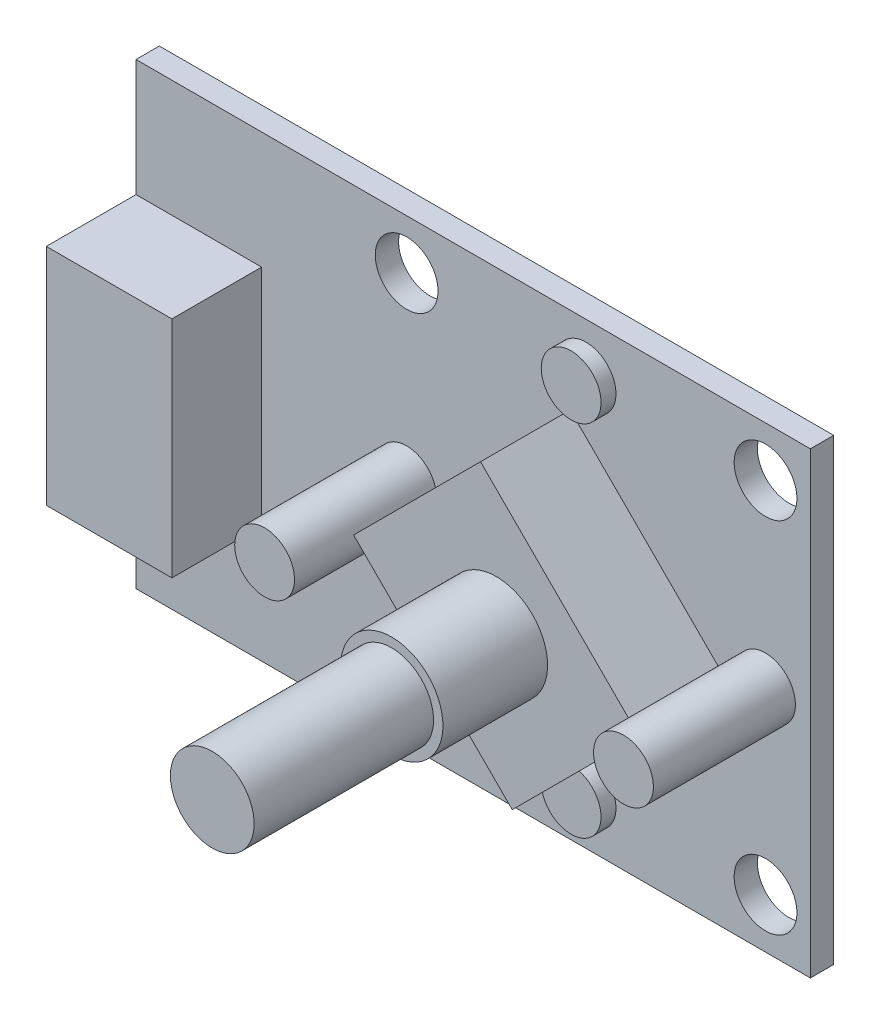
ISO-10303-21;
HEADER;
FILE_DESCRIPTION(('STEP AP214'),'2;1');
FILE_NAME('part.step','',(''),(''),'','','');
FILE_SCHEMA(('AUTOMOTIVE_DESIGN { 1 0 10303 214 1 1 1 1 }'));
ENDSEC;
DATA;
#1=APPLICATION_CONTEXT('core data for automotive mechanical design processes');
#2=APPLICATION_PROTOCOL_DEFINITION('international standard','automotive_design',2000,#1);
#3=PRODUCT_CONTEXT('',#1,'mechanical');
#4=PRODUCT('Part','Part','',(#3));
#5=PRODUCT_RELATED_PRODUCT_CATEGORY('part','',(#4));
#6=PRODUCT_DEFINITION_FORMATION('','',#4);
#7=PRODUCT_DEFINITION_CONTEXT('part definition',#1,'design');
#8=PRODUCT_DEFINITION('design','',#6,#7);
#9=PRODUCT_DEFINITION_SHAPE('','',#8);
#10=(LENGTH_UNIT() NAMED_UNIT(*) SI_UNIT(.MILLI.,.METRE.));
#11=(NAMED_UNIT(*) PLANE_ANGLE_UNIT() SI_UNIT($,.RADIAN.));
#12=(NAMED_UNIT(*) SI_UNIT($,.STERADIAN.) SOLID_ANGLE_UNIT());
#13=UNCERTAINTY_MEASURE_WITH_UNIT(LENGTH_MEASURE(1.E-05),#10,'distance_accuracy_value','');
#14=(GEOMETRIC_REPRESENTATION_CONTEXT(3) GLOBAL_UNCERTAINTY_ASSIGNED_CONTEXT((#13)) GLOBAL_UNIT_ASSIGNED_CONTEXT((#10,
#11,#12)) REPRESENTATION_CONTEXT('',''));
#15=CARTESIAN_POINT('',(0.,0.,0.));
#16=DIRECTION('',(0.,0.,1.));
#17=DIRECTION('',(1.,0.,0.));
#18=AXIS2_PLACEMENT_3D('',#15,#16,#17);
#19=CARTESIAN_POINT('',(0.,0.,0.));
#20=DIRECTION('',(0.,0.,1.));
#21=DIRECTION('',(1.,0.,0.));
#22=AXIS2_PLACEMENT_3D('',#19,#20,#21);
#23=PLANE('',#22);
#24=CARTESIAN_POINT('',(19.55,-12.,0.));
#25=DIRECTION('',(0.,0.,-1.));
#26=DIRECTION('',(1.,0.,0.));
#27=AXIS2_PLACEMENT_3D('',#24,#25,#26);
#28=CIRCLE('',#27,2.1);
#29=CARTESIAN_POINT('',(17.45,-12.,0.));
#30=VERTEX_POINT('',#29);
#31=EDGE_CURVE('P0_E123',#30,#30,#28,.T.);
#32=ORIENTED_EDGE('',*,*,#31,.F.);
#33=EDGE_LOOP('',(#32));
#34=FACE_BOUND('',#33,.T.);
#35=CARTESIAN_POINT('',(19.55,12.,0.));
#36=DIRECTION('',(0.,0.,-1.));
#37=DIRECTION('',(1.,0.,0.));
#38=AXIS2_PLACEMENT_3D('',#35,#36,#37);
#39=CIRCLE('',#38,2.1);
#40=CARTESIAN_POINT('',(17.45,12.,0.));
#41=VERTEX_POINT('',#40);
#42=EDGE_CURVE('P0_E153',#41,#41,#39,.T.);
#43=ORIENTED_EDGE('',*,*,#42,.F.);
#44=EDGE_LOOP('',(#43));
#45=FACE_BOUND('',#44,.T.);
#46=CARTESIAN_POINT('',(-4.45,-12.,0.));
#47=DIRECTION('',(0.,0.,-1.));
#48=DIRECTION('',(1.,0.,0.));
#49=AXIS2_PLACEMENT_3D('',#46,#47,#48);
#50=CIRCLE('',#49,2.1);
#51=CARTESIAN_POINT('',(-6.55,-12.,0.));
#52=VERTEX_POINT('',#51);
#53=EDGE_CURVE('P0_E129',#52,#52,#50,.T.);
#54=ORIENTED_EDGE('',*,*,#53,.F.);
#55=EDGE_LOOP('',(#54));
#56=FACE_BOUND('',#55,.T.);
#57=CARTESIAN_POINT('',(-4.45,12.,0.));
#58=DIRECTION('',(0.,0.,-1.));
#59=DIRECTION('',(1.,0.,0.));
#60=AXIS2_PLACEMENT_3D('',#57,#58,#59);
#61=CIRCLE('',#60,2.1);
#62=CARTESIAN_POINT('',(-6.55,12.,0.));
#63=VERTEX_POINT('',#62);
#64=EDGE_CURVE('P0_E114',#63,#63,#61,.T.);
#65=ORIENTED_EDGE('',*,*,#64,.F.);
#66=EDGE_LOOP('',(#65));
#67=FACE_BOUND('',#66,.T.);
#68=DIRECTION('',(0.,-1.,0.));
#69=VECTOR('',#68,1.);
#70=CARTESIAN_POINT('',(-22.55,7.5,0.));
#71=LINE('',#70,#69);
#72=CARTESIAN_POINT('',(-22.55,15.325,0.));
#73=VERTEX_POINT('',#72);
#74=CARTESIAN_POINT('',(-22.55,-15.325,0.));
#75=VERTEX_POINT('',#74);
#76=EDGE_CURVE('P0_E28',#73,#75,#71,.T.);
#77=ORIENTED_EDGE('',*,*,#76,.F.);
#78=DIRECTION('',(-1.,0.,0.));
#79=VECTOR('',#78,1.);
#80=CARTESIAN_POINT('',(22.55,15.325,0.));
#81=LINE('',#80,#79);
#82=CARTESIAN_POINT('',(22.55,15.325,0.));
#83=VERTEX_POINT('',#82);
#84=EDGE_CURVE('P0_E99',#83,#73,#81,.T.);
#85=ORIENTED_EDGE('',*,*,#84,.F.);
#86=DIRECTION('',(0.,1.,0.));
#87=VECTOR('',#86,1.);
#88=CARTESIAN_POINT('',(22.55,-15.325,0.));
#89=LINE('',#88,#87);
#90=CARTESIAN_POINT('',(22.55,-15.325,0.));
#91=VERTEX_POINT('',#90);
#92=EDGE_CURVE('P0_E139',#91,#83,#89,.T.);
#93=ORIENTED_EDGE('',*,*,#92,.F.);
#94=DIRECTION('',(1.,0.,0.));
#95=VECTOR('',#94,1.);
#96=CARTESIAN_POINT('',(-22.55,-15.325,0.));
#97=LINE('',#96,#95);
#98=EDGE_CURVE('P0_E55',#75,#91,#97,.T.);
#99=ORIENTED_EDGE('',*,*,#98,.F.);
#100=EDGE_LOOP('',(#77,#85,#93,#99));
#101=FACE_BOUND('',#100,.T.);
#102=ADVANCED_FACE('P0_F17',(#34,#45,#56,#67,#101),#23,.F.);
#103=CARTESIAN_POINT('',(0.,0.,1.56));
#104=DIRECTION('',(0.,0.,1.));
#105=DIRECTION('',(1.,0.,0.));
#106=AXIS2_PLACEMENT_3D('',#103,#104,#105);
#107=PLANE('',#106);
#108=CARTESIAN_POINT('',(19.55,-12.,1.56));
#109=DIRECTION('',(0.,0.,-1.));
#110=DIRECTION('',(1.,0.,0.));
#111=AXIS2_PLACEMENT_3D('',#108,#109,#110);
#112=CIRCLE('',#111,2.1);
#113=CARTESIAN_POINT('',(17.45,-12.,1.56));
#114=VERTEX_POINT('',#113);
#115=EDGE_CURVE('P0_E131',#114,#114,#112,.T.);
#116=ORIENTED_EDGE('',*,*,#115,.T.);
#117=EDGE_LOOP('',(#116));
#118=FACE_BOUND('',#117,.T.);
#119=CARTESIAN_POINT('',(19.55,12.,1.56));
#120=DIRECTION('',(0.,0.,-1.));
#121=DIRECTION('',(1.,0.,0.));
#122=AXIS2_PLACEMENT_3D('',#119,#120,#121);
#123=CIRCLE('',#122,2.1);
#124=CARTESIAN_POINT('',(17.45,12.,1.56));
#125=VERTEX_POINT('',#124);
#126=EDGE_CURVE('P0_E169',#125,#125,#123,.T.);
#127=ORIENTED_EDGE('',*,*,#126,.T.);
#128=EDGE_LOOP('',(#127));
#129=FACE_BOUND('',#128,.T.);
#130=CARTESIAN_POINT('',(-4.45,-12.,1.56));
#131=DIRECTION('',(0.,0.,-1.));
#132=DIRECTION('',(1.,0.,0.));
#133=AXIS2_PLACEMENT_3D('',#130,#131,#132);
#134=CIRCLE('',#133,2.1);
#135=CARTESIAN_POINT('',(-6.55,-12.,1.56));
#136=VERTEX_POINT('',#135);
#137=EDGE_CURVE('P0_E130',#136,#136,#134,.T.);
#138=ORIENTED_EDGE('',*,*,#137,.T.);
#139=EDGE_LOOP('',(#138));
#140=FACE_BOUND('',#139,.T.);
#141=CARTESIAN_POINT('',(-4.45,12.,1.56));
#142=DIRECTION('',(0.,0.,-1.));
#143=DIRECTION('',(1.,0.,0.));
#144=AXIS2_PLACEMENT_3D('',#141,#142,#143);
#145=CIRCLE('',#144,2.1);
#146=CARTESIAN_POINT('',(-6.55,12.,1.56));
#147=VERTEX_POINT('',#146);
#148=EDGE_CURVE('P0_E145',#147,#147,#145,.T.);
#149=ORIENTED_EDGE('',*,*,#148,.T.);
#150=EDGE_LOOP('',(#149));
#151=FACE_BOUND('',#150,.T.);
#152=DIRECTION('',(0.,-1.,0.));
#153=VECTOR('',#152,1.);
#154=CARTESIAN_POINT('',(-22.55,7.5,1.56));
#155=LINE('',#154,#153);
#156=CARTESIAN_POINT('',(-22.55,15.325,1.56));
#157=VERTEX_POINT('',#156);
#158=CARTESIAN_POINT('',(-22.55,-15.325,1.56));
#159=VERTEX_POINT('',#158);
#160=EDGE_CURVE('P0_E11',#157,#159,#155,.T.);
#161=ORIENTED_EDGE('',*,*,#160,.T.);
#162=DIRECTION('',(1.,0.,0.));
#163=VECTOR('',#162,1.);
#164=CARTESIAN_POINT('',(-22.55,-15.325,1.56));
#165=LINE('',#164,#163);
#166=CARTESIAN_POINT('',(22.55,-15.325,1.56));
#167=VERTEX_POINT('',#166);
#168=EDGE_CURVE('P0_E142',#159,#167,#165,.T.);
#169=ORIENTED_EDGE('',*,*,#168,.T.);
#170=DIRECTION('',(0.,1.,0.));
#171=VECTOR('',#170,1.);
#172=CARTESIAN_POINT('',(22.55,-15.325,1.56));
#173=LINE('',#172,#171);
#174=CARTESIAN_POINT('',(22.55,15.325,1.56));
#175=VERTEX_POINT('',#174);
#176=EDGE_CURVE('P0_E67',#167,#175,#173,.T.);
#177=ORIENTED_EDGE('',*,*,#176,.T.);
#178=DIRECTION('',(-1.,0.,0.));
#179=VECTOR('',#178,1.);
#180=CARTESIAN_POINT('',(22.55,15.325,1.56));
#181=LINE('',#180,#179);
#182=EDGE_CURVE('P0_E21',#175,#157,#181,.T.);
#183=ORIENTED_EDGE('',*,*,#182,.T.);
#184=EDGE_LOOP('',(#161,#169,#177,#183));
#185=FACE_BOUND('',#184,.T.);
#186=ADVANCED_FACE('P0_F195',(#118,#129,#140,#151,#185),#107,.T.);
#187=CARTESIAN_POINT('',(-22.55,15.325,0.));
#188=DIRECTION('',(-1.,0.,0.));
#189=DIRECTION('',(0.,0.,1.));
#190=AXIS2_PLACEMENT_3D('',#187,#188,#189);
#191=PLANE('',#190);
#192=ORIENTED_EDGE('',*,*,#76,.T.);
#193=DIRECTION('',(0.,0.,1.));
#194=VECTOR('',#193,1.);
#195=CARTESIAN_POINT('',(-22.55,-15.325,0.));
#196=LINE('',#195,#194);
#197=EDGE_CURVE('P0_E102',#75,#159,#196,.T.);
#198=ORIENTED_EDGE('',*,*,#197,.T.);
#199=ORIENTED_EDGE('',*,*,#160,.F.);
#200=DIRECTION('',(0.,0.,1.));
#201=VECTOR('',#200,1.);
#202=CARTESIAN_POINT('',(-22.55,15.325,0.));
#203=LINE('',#202,#201);
#204=EDGE_CURVE('P0_E105',#73,#157,#203,.T.);
#205=ORIENTED_EDGE('',*,*,#204,.F.);
#206=EDGE_LOOP('',(#192,#198,#199,#205));
#207=FACE_BOUND('',#206,.T.);
#208=ADVANCED_FACE('P0_F19',(#207),#191,.T.);
#209=CARTESIAN_POINT('',(-22.55,-15.325,0.));
#210=DIRECTION('',(0.,-1.,0.));
#211=DIRECTION('',(0.,0.,-1.));
#212=AXIS2_PLACEMENT_3D('',#209,#210,#211);
#213=PLANE('',#212);
#214=ORIENTED_EDGE('',*,*,#98,.T.);
#215=DIRECTION('',(0.,0.,1.));
#216=VECTOR('',#215,1.);
#217=CARTESIAN_POINT('',(22.55,-15.325,0.));
#218=LINE('',#217,#216);
#219=EDGE_CURVE('P0_E138',#91,#167,#218,.T.);
#220=ORIENTED_EDGE('',*,*,#219,.T.);
#221=ORIENTED_EDGE('',*,*,#168,.F.);
#222=ORIENTED_EDGE('',*,*,#197,.F.);
#223=EDGE_LOOP('',(#214,#220,#221,#222));
#224=FACE_BOUND('',#223,.T.);
#225=ADVANCED_FACE('P0_F194',(#224),#213,.T.);
#226=CARTESIAN_POINT('',(22.55,-15.325,0.));
#227=DIRECTION('',(1.,0.,0.));
#228=DIRECTION('',(0.,1.,0.));
#229=AXIS2_PLACEMENT_3D('',#226,#227,#228);
#230=PLANE('',#229);
#231=ORIENTED_EDGE('',*,*,#92,.T.);
#232=DIRECTION('',(0.,0.,1.));
#233=VECTOR('',#232,1.);
#234=CARTESIAN_POINT('',(22.55,15.325,0.));
#235=LINE('',#234,#233);
#236=EDGE_CURVE('P0_E112',#83,#175,#235,.T.);
#237=ORIENTED_EDGE('',*,*,#236,.T.);
#238=ORIENTED_EDGE('',*,*,#176,.F.);
#239=ORIENTED_EDGE('',*,*,#219,.F.);
#240=EDGE_LOOP('',(#231,#237,#238,#239));
#241=FACE_BOUND('',#240,.T.);
#242=ADVANCED_FACE('P0_F192',(#241),#230,.T.);
#243=CARTESIAN_POINT('',(22.55,15.325,0.));
#244=DIRECTION('',(0.,1.,0.));
#245=DIRECTION('',(1.,0.,0.));
#246=AXIS2_PLACEMENT_3D('',#243,#244,#245);
#247=PLANE('',#246);
#248=ORIENTED_EDGE('',*,*,#84,.T.);
#249=ORIENTED_EDGE('',*,*,#204,.T.);
#250=ORIENTED_EDGE('',*,*,#182,.F.);
#251=ORIENTED_EDGE('',*,*,#236,.F.);
#252=EDGE_LOOP('',(#248,#249,#250,#251));
#253=FACE_BOUND('',#252,.T.);
#254=ADVANCED_FACE('P0_F111',(#253),#247,.T.);
#255=CARTESIAN_POINT('',(-4.45,12.,0.));
#256=DIRECTION('',(0.,0.,1.));
#257=DIRECTION('',(1.,0.,0.));
#258=AXIS2_PLACEMENT_3D('',#255,#256,#257);
#259=CYLINDRICAL_SURFACE('',#258,2.1);
#260=ORIENTED_EDGE('',*,*,#148,.F.);
#261=DIRECTION('',(0.,0.,-1.));
#262=VECTOR('',#261,1.);
#263=CARTESIAN_POINT('',(-6.55,12.,0.));
#264=LINE('',#263,#262);
#265=EDGE_CURVE('P0_E120',#147,#63,#264,.T.);
#266=ORIENTED_EDGE('',*,*,#265,.T.);
#267=ORIENTED_EDGE('',*,*,#64,.T.);
#268=ORIENTED_EDGE('',*,*,#265,.F.);
#269=EDGE_LOOP('',(#260,#266,#267,#268));
#270=FACE_BOUND('',#269,.T.);
#271=ADVANCED_FACE('P0_F211',(#270),#259,.F.);
#272=CARTESIAN_POINT('',(-4.45,-12.,0.));
#273=DIRECTION('',(0.,0.,1.));
#274=DIRECTION('',(1.,0.,0.));
#275=AXIS2_PLACEMENT_3D('',#272,#273,#274);
#276=CYLINDRICAL_SURFACE('',#275,2.1);
#277=ORIENTED_EDGE('',*,*,#137,.F.);
#278=DIRECTION('',(0.,0.,-1.));
#279=VECTOR('',#278,1.);
#280=CARTESIAN_POINT('',(-6.55,-12.,0.));
#281=LINE('',#280,#279);
#282=EDGE_CURVE('P0_E125',#136,#52,#281,.T.);
#283=ORIENTED_EDGE('',*,*,#282,.T.);
#284=ORIENTED_EDGE('',*,*,#53,.T.);
#285=ORIENTED_EDGE('',*,*,#282,.F.);
#286=EDGE_LOOP('',(#277,#283,#284,#285));
#287=FACE_BOUND('',#286,.T.);
#288=ADVANCED_FACE('P0_F207',(#287),#276,.F.);
#289=CARTESIAN_POINT('',(19.55,12.,0.));
#290=DIRECTION('',(0.,0.,1.));
#291=DIRECTION('',(1.,0.,0.));
#292=AXIS2_PLACEMENT_3D('',#289,#290,#291);
#293=CYLINDRICAL_SURFACE('',#292,2.1);
#294=ORIENTED_EDGE('',*,*,#126,.F.);
#295=DIRECTION('',(0.,0.,-1.));
#296=VECTOR('',#295,1.);
#297=CARTESIAN_POINT('',(17.45,12.,0.));
#298=LINE('',#297,#296);
#299=EDGE_CURVE('P0_E166',#125,#41,#298,.T.);
#300=ORIENTED_EDGE('',*,*,#299,.T.);
#301=ORIENTED_EDGE('',*,*,#42,.T.);
#302=ORIENTED_EDGE('',*,*,#299,.F.);
#303=EDGE_LOOP('',(#294,#300,#301,#302));
#304=FACE_BOUND('',#303,.T.);
#305=ADVANCED_FACE('P0_F210',(#304),#293,.F.);
#306=CARTESIAN_POINT('',(19.55,-12.,0.));
#307=DIRECTION('',(0.,0.,1.));
#308=DIRECTION('',(1.,0.,0.));
#309=AXIS2_PLACEMENT_3D('',#306,#307,#308);
#310=CYLINDRICAL_SURFACE('',#309,2.1);
#311=ORIENTED_EDGE('',*,*,#115,.F.);
#312=DIRECTION('',(0.,0.,-1.));
#313=VECTOR('',#312,1.);
#314=CARTESIAN_POINT('',(17.45,-12.,0.));
#315=LINE('',#314,#313);
#316=EDGE_CURVE('P0_E135',#114,#30,#315,.T.);
#317=ORIENTED_EDGE('',*,*,#316,.T.);
#318=ORIENTED_EDGE('',*,*,#31,.T.);
#319=ORIENTED_EDGE('',*,*,#316,.F.);
#320=EDGE_LOOP('',(#311,#317,#318,#319));
#321=FACE_BOUND('',#320,.T.);
#322=ADVANCED_FACE('P0_F217',(#321),#310,.F.);
#323=CLOSED_SHELL('',(#102,#186,#208,#225,#242,#254,#271,#288,#305,#322));
#324=MANIFOLD_SOLID_BREP('P0_B1',#323);
#325=CARTESIAN_POINT('',(-18.35,0.,1.56));
#326=DIRECTION('',(0.,0.,1.));
#327=DIRECTION('',(1.,0.,0.));
#328=AXIS2_PLACEMENT_3D('',#325,#326,#327);
#329=PLANE('',#328);
#330=DIRECTION('',(1.,0.,0.));
#331=VECTOR('',#330,1.);
#332=CARTESIAN_POINT('',(-16.25,7.5,1.56));
#333=LINE('',#332,#331);
#334=CARTESIAN_POINT('',(-22.55,7.5,1.56));
#335=VERTEX_POINT('',#334);
#336=CARTESIAN_POINT('',(-14.15,7.5,1.56));
#337=VERTEX_POINT('',#336);
#338=EDGE_CURVE('P1_E27',#335,#337,#333,.T.);
#339=ORIENTED_EDGE('',*,*,#338,.T.);
#340=DIRECTION('',(0.,-1.,0.));
#341=VECTOR('',#340,1.);
#342=CARTESIAN_POINT('',(-14.15,-3.75,1.56));
#343=LINE('',#342,#341);
#344=CARTESIAN_POINT('',(-14.15,-7.5,1.56));
#345=VERTEX_POINT('',#344);
#346=EDGE_CURVE('P1_E68',#337,#345,#343,.T.);
#347=ORIENTED_EDGE('',*,*,#346,.T.);
#348=DIRECTION('',(-1.,0.,0.));
#349=VECTOR('',#348,1.);
#350=CARTESIAN_POINT('',(-20.45,-7.5,1.56));
#351=LINE('',#350,#349);
#352=CARTESIAN_POINT('',(-22.55,-7.5,1.56));
#353=VERTEX_POINT('',#352);
#354=EDGE_CURVE('P1_E92',#345,#353,#351,.T.);
#355=ORIENTED_EDGE('',*,*,#354,.T.);
#356=DIRECTION('',(0.,1.,0.));
#357=VECTOR('',#356,1.);
#358=CARTESIAN_POINT('',(-22.55,3.75,1.56));
#359=LINE('',#358,#357);
#360=EDGE_CURVE('P1_E70',#353,#335,#359,.T.);
#361=ORIENTED_EDGE('',*,*,#360,.T.);
#362=EDGE_LOOP('',(#339,#347,#355,#361));
#363=FACE_BOUND('',#362,.T.);
#364=ADVANCED_FACE('P1_F16',(#363),#329,.F.);
#365=CARTESIAN_POINT('',(-18.35,0.,7.56));
#366=DIRECTION('',(0.,0.,1.));
#367=DIRECTION('',(1.,0.,0.));
#368=AXIS2_PLACEMENT_3D('',#365,#366,#367);
#369=PLANE('',#368);
#370=DIRECTION('',(-1.,0.,0.));
#371=VECTOR('',#370,1.);
#372=CARTESIAN_POINT('',(-16.25,7.5,7.56));
#373=LINE('',#372,#371);
#374=CARTESIAN_POINT('',(-14.15,7.5,7.56));
#375=VERTEX_POINT('',#374);
#376=CARTESIAN_POINT('',(-22.55,7.5,7.56));
#377=VERTEX_POINT('',#376);
#378=EDGE_CURVE('P1_E11',#375,#377,#373,.T.);
#379=ORIENTED_EDGE('',*,*,#378,.T.);
#380=DIRECTION('',(0.,-1.,0.));
#381=VECTOR('',#380,1.);
#382=CARTESIAN_POINT('',(-22.55,3.75,7.56));
#383=LINE('',#382,#381);
#384=CARTESIAN_POINT('',(-22.55,-7.5,7.56));
#385=VERTEX_POINT('',#384);
#386=EDGE_CURVE('P1_E116',#377,#385,#383,.T.);
#387=ORIENTED_EDGE('',*,*,#386,.T.);
#388=DIRECTION('',(1.,0.,0.));
#389=VECTOR('',#388,1.);
#390=CARTESIAN_POINT('',(-20.45,-7.5,7.56));
#391=LINE('',#390,#389);
#392=CARTESIAN_POINT('',(-14.15,-7.5,7.56));
#393=VERTEX_POINT('',#392);
#394=EDGE_CURVE('P1_E94',#385,#393,#391,.T.);
#395=ORIENTED_EDGE('',*,*,#394,.T.);
#396=DIRECTION('',(0.,1.,0.));
#397=VECTOR('',#396,1.);
#398=CARTESIAN_POINT('',(-14.15,-3.75,7.56));
#399=LINE('',#398,#397);
#400=EDGE_CURVE('P1_E79',#393,#375,#399,.T.);
#401=ORIENTED_EDGE('',*,*,#400,.T.);
#402=EDGE_LOOP('',(#379,#387,#395,#401));
#403=FACE_BOUND('',#402,.T.);
#404=ADVANCED_FACE('P1_F171',(#403),#369,.T.);
#405=CARTESIAN_POINT('',(-14.15,7.5,1.56));
#406=DIRECTION('',(0.,1.,0.));
#407=DIRECTION('',(1.,0.,0.));
#408=AXIS2_PLACEMENT_3D('',#405,#406,#407);
#409=PLANE('',#408);
#410=ORIENTED_EDGE('',*,*,#338,.F.);
#411=DIRECTION('',(0.,0.,1.));
#412=VECTOR('',#411,1.);
#413=CARTESIAN_POINT('',(-22.55,7.5,1.56));
#414=LINE('',#413,#412);
#415=EDGE_CURVE('P1_E20',#335,#377,#414,.T.);
#416=ORIENTED_EDGE('',*,*,#415,.T.);
#417=ORIENTED_EDGE('',*,*,#378,.F.);
#418=DIRECTION('',(0.,0.,1.));
#419=VECTOR('',#418,1.);
#420=CARTESIAN_POINT('',(-14.15,7.5,1.56));
#421=LINE('',#420,#419);
#422=EDGE_CURVE('P1_E75',#337,#375,#421,.T.);
#423=ORIENTED_EDGE('',*,*,#422,.F.);
#424=EDGE_LOOP('',(#410,#416,#417,#423));
#425=FACE_BOUND('',#424,.T.);
#426=ADVANCED_FACE('P1_F18',(#425),#409,.T.);
#427=CARTESIAN_POINT('',(-22.55,7.5,1.56));
#428=DIRECTION('',(-1.,0.,0.));
#429=DIRECTION('',(0.,0.,1.));
#430=AXIS2_PLACEMENT_3D('',#427,#428,#429);
#431=PLANE('',#430);
#432=ORIENTED_EDGE('',*,*,#360,.F.);
#433=DIRECTION('',(0.,0.,1.));
#434=VECTOR('',#433,1.);
#435=CARTESIAN_POINT('',(-22.55,-7.5,1.56));
#436=LINE('',#435,#434);
#437=EDGE_CURVE('P1_E97',#353,#385,#436,.T.);
#438=ORIENTED_EDGE('',*,*,#437,.T.);
#439=ORIENTED_EDGE('',*,*,#386,.F.);
#440=ORIENTED_EDGE('',*,*,#415,.F.);
#441=EDGE_LOOP('',(#432,#438,#439,#440));
#442=FACE_BOUND('',#441,.T.);
#443=ADVANCED_FACE('P1_F115',(#442),#431,.T.);
#444=CARTESIAN_POINT('',(-22.55,-7.5,1.56));
#445=DIRECTION('',(0.,-1.,0.));
#446=DIRECTION('',(0.,0.,-1.));
#447=AXIS2_PLACEMENT_3D('',#444,#445,#446);
#448=PLANE('',#447);
#449=ORIENTED_EDGE('',*,*,#354,.F.);
#450=DIRECTION('',(0.,0.,1.));
#451=VECTOR('',#450,1.);
#452=CARTESIAN_POINT('',(-14.15,-7.5,1.56));
#453=LINE('',#452,#451);
#454=EDGE_CURVE('P1_E84',#345,#393,#453,.T.);
#455=ORIENTED_EDGE('',*,*,#454,.T.);
#456=ORIENTED_EDGE('',*,*,#394,.F.);
#457=ORIENTED_EDGE('',*,*,#437,.F.);
#458=EDGE_LOOP('',(#449,#455,#456,#457));
#459=FACE_BOUND('',#458,.T.);
#460=ADVANCED_FACE('P1_F112',(#459),#448,.T.);
#461=CARTESIAN_POINT('',(-14.15,-7.5,1.56));
#462=DIRECTION('',(1.,0.,0.));
#463=DIRECTION('',(0.,1.,0.));
#464=AXIS2_PLACEMENT_3D('',#461,#462,#463);
#465=PLANE('',#464);
#466=ORIENTED_EDGE('',*,*,#346,.F.);
#467=ORIENTED_EDGE('',*,*,#422,.T.);
#468=ORIENTED_EDGE('',*,*,#400,.F.);
#469=ORIENTED_EDGE('',*,*,#454,.F.);
#470=EDGE_LOOP('',(#466,#467,#468,#469));
#471=FACE_BOUND('',#470,.T.);
#472=ADVANCED_FACE('P1_F82',(#471),#465,.T.);
#473=CLOSED_SHELL('',(#364,#404,#426,#443,#460,#472));
#474=MANIFOLD_SOLID_BREP('P1_B1',#473);
#475=CARTESIAN_POINT('',(7.55,0.,1.56));
#476=DIRECTION('',(0.,0.,1.));
#477=DIRECTION('',(1.,0.,0.));
#478=AXIS2_PLACEMENT_3D('',#475,#476,#477);
#479=PLANE('',#478);
#480=DIRECTION('',(-0.707106781186547,0.707106781186548,0.));
#481=VECTOR('',#480,1.);
#482=CARTESIAN_POINT('',(0.655708883431173,-1.59099025766972,1.56));
#483=LINE('',#482,#481);
#484=CARTESIAN_POINT('',(8.61066017177981,-9.54594154601837,1.56));
#485=VERTEX_POINT('',#484);
#486=CARTESIAN_POINT('',(-1.99594154601837,1.06066017177983,1.56));
#487=VERTEX_POINT('',#486);
#488=EDGE_CURVE('P2_E28',#485,#487,#483,.T.);
#489=ORIENTED_EDGE('',*,*,#488,.T.);
#490=DIRECTION('',(0.707106781186548,0.707106781186547,0.));
#491=VECTOR('',#490,1.);
#492=CARTESIAN_POINT('',(4.36801948466056,7.42462120245876,1.56));
#493=LINE('',#492,#491);
#494=CARTESIAN_POINT('',(6.4893398282202,9.54594154601839,1.56));
#495=VERTEX_POINT('',#494);
#496=EDGE_CURVE('P2_E139',#487,#495,#493,.T.);
#497=ORIENTED_EDGE('',*,*,#496,.T.);
#498=DIRECTION('',(0.707106781186547,-0.707106781186548,0.));
#499=VECTOR('',#498,1.);
#500=CARTESIAN_POINT('',(14.4442911165689,1.59099025766973,1.56));
#501=LINE('',#500,#499);
#502=CARTESIAN_POINT('',(17.0959415460184,-1.06066017177983,1.56));
#503=VERTEX_POINT('',#502);
#504=EDGE_CURVE('P2_E120',#495,#503,#501,.T.);
#505=ORIENTED_EDGE('',*,*,#504,.T.);
#506=DIRECTION('',(-0.70710678118655,-0.707106781186545,0.));
#507=VECTOR('',#506,1.);
#508=CARTESIAN_POINT('',(10.7319805153395,-7.42462120245874,1.56));
#509=LINE('',#508,#507);
#510=EDGE_CURVE('P2_E100',#503,#485,#509,.T.);
#511=ORIENTED_EDGE('',*,*,#510,.T.);
#512=EDGE_LOOP('',(#489,#497,#505,#511));
#513=FACE_BOUND('',#512,.T.);
#514=ADVANCED_FACE('P2_F17',(#513),#479,.F.);
#515=CARTESIAN_POINT('',(7.55,0.,7.56));
#516=DIRECTION('',(0.,0.,1.));
#517=DIRECTION('',(1.,0.,0.));
#518=AXIS2_PLACEMENT_3D('',#515,#516,#517);
#519=PLANE('',#518);
#520=CARTESIAN_POINT('',(7.55,0.,7.56));
#521=DIRECTION('',(0.,0.,-1.));
#522=DIRECTION('',(1.,0.,0.));
#523=AXIS2_PLACEMENT_3D('',#520,#521,#522);
#524=CIRCLE('',#523,3.425);
#525=CARTESIAN_POINT('',(4.125,0.,7.56));
#526=VERTEX_POINT('',#525);
#527=EDGE_CURVE('P2_E143',#526,#526,#524,.T.);
#528=ORIENTED_EDGE('',*,*,#527,.T.);
#529=EDGE_LOOP('',(#528));
#530=FACE_BOUND('',#529,.T.);
#531=DIRECTION('',(0.707106781186547,-0.707106781186548,0.));
#532=VECTOR('',#531,1.);
#533=CARTESIAN_POINT('',(0.655708883431173,-1.59099025766972,7.56));
#534=LINE('',#533,#532);
#535=CARTESIAN_POINT('',(-1.99594154601837,1.06066017177983,7.56));
#536=VERTEX_POINT('',#535);
#537=CARTESIAN_POINT('',(8.61066017177981,-9.54594154601837,7.56));
#538=VERTEX_POINT('',#537);
#539=EDGE_CURVE('P2_E11',#536,#538,#534,.T.);
#540=ORIENTED_EDGE('',*,*,#539,.T.);
#541=DIRECTION('',(0.70710678118655,0.707106781186545,0.));
#542=VECTOR('',#541,1.);
#543=CARTESIAN_POINT('',(10.7319805153395,-7.42462120245874,7.56));
#544=LINE('',#543,#542);
#545=CARTESIAN_POINT('',(17.0959415460184,-1.06066017177983,7.56));
#546=VERTEX_POINT('',#545);
#547=EDGE_CURVE('P2_E104',#538,#546,#544,.T.);
#548=ORIENTED_EDGE('',*,*,#547,.T.);
#549=DIRECTION('',(-0.707106781186547,0.707106781186548,0.));
#550=VECTOR('',#549,1.);
#551=CARTESIAN_POINT('',(14.4442911165689,1.59099025766973,7.56));
#552=LINE('',#551,#550);
#553=CARTESIAN_POINT('',(6.4893398282202,9.54594154601839,7.56));
#554=VERTEX_POINT('',#553);
#555=EDGE_CURVE('P2_E91',#546,#554,#552,.T.);
#556=ORIENTED_EDGE('',*,*,#555,.T.);
#557=DIRECTION('',(-0.707106781186548,-0.707106781186547,0.));
#558=VECTOR('',#557,1.);
#559=CARTESIAN_POINT('',(4.36801948466056,7.42462120245876,7.56));
#560=LINE('',#559,#558);
#561=EDGE_CURVE('P2_E21',#554,#536,#560,.T.);
#562=ORIENTED_EDGE('',*,*,#561,.T.);
#563=EDGE_LOOP('',(#540,#548,#556,#562));
#564=FACE_BOUND('',#563,.T.);
#565=ADVANCED_FACE('P2_F105',(#530,#564),#519,.T.);
#566=CARTESIAN_POINT('',(-1.99594154601837,1.06066017177983,1.56));
#567=DIRECTION('',(-0.707106781186548,-0.707106781186547,0.));
#568=DIRECTION('',(-0.707106781186547,0.707106781186548,0.));
#569=AXIS2_PLACEMENT_3D('',#566,#567,#568);
#570=PLANE('',#569);
#571=ORIENTED_EDGE('',*,*,#488,.F.);
#572=DIRECTION('',(0.,0.,1.));
#573=VECTOR('',#572,1.);
#574=CARTESIAN_POINT('',(8.61066017177981,-9.54594154601837,1.56));
#575=LINE('',#574,#573);
#576=EDGE_CURVE('P2_E107',#485,#538,#575,.T.);
#577=ORIENTED_EDGE('',*,*,#576,.T.);
#578=ORIENTED_EDGE('',*,*,#539,.F.);
#579=DIRECTION('',(0.,0.,1.));
#580=VECTOR('',#579,1.);
#581=CARTESIAN_POINT('',(-1.99594154601837,1.06066017177983,1.56));
#582=LINE('',#581,#580);
#583=EDGE_CURVE('P2_E136',#487,#536,#582,.T.);
#584=ORIENTED_EDGE('',*,*,#583,.F.);
#585=EDGE_LOOP('',(#571,#577,#578,#584));
#586=FACE_BOUND('',#585,.T.);
#587=ADVANCED_FACE('P2_F19',(#586),#570,.T.);
#588=CARTESIAN_POINT('',(8.61066017177981,-9.54594154601837,1.56));
#589=DIRECTION('',(0.707106781186545,-0.70710678118655,0.));
#590=DIRECTION('',(0.,0.,-1.));
#591=AXIS2_PLACEMENT_3D('',#588,#589,#590);
#592=PLANE('',#591);
#593=ORIENTED_EDGE('',*,*,#510,.F.);
#594=DIRECTION('',(0.,0.,1.));
#595=VECTOR('',#594,1.);
#596=CARTESIAN_POINT('',(17.0959415460184,-1.06066017177983,1.56));
#597=LINE('',#596,#595);
#598=EDGE_CURVE('P2_E109',#503,#546,#597,.T.);
#599=ORIENTED_EDGE('',*,*,#598,.T.);
#600=ORIENTED_EDGE('',*,*,#547,.F.);
#601=ORIENTED_EDGE('',*,*,#576,.F.);
#602=EDGE_LOOP('',(#593,#599,#600,#601));
#603=FACE_BOUND('',#602,.T.);
#604=ADVANCED_FACE('P2_F110',(#603),#592,.T.);
#605=CARTESIAN_POINT('',(17.0959415460184,-1.06066017177983,1.56));
#606=DIRECTION('',(0.707106781186548,0.707106781186547,0.));
#607=DIRECTION('',(0.,0.,-1.));
#608=AXIS2_PLACEMENT_3D('',#605,#606,#607);
#609=PLANE('',#608);
#610=ORIENTED_EDGE('',*,*,#504,.F.);
#611=DIRECTION('',(0.,0.,1.));
#612=VECTOR('',#611,1.);
#613=CARTESIAN_POINT('',(6.4893398282202,9.54594154601839,1.56));
#614=LINE('',#613,#612);
#615=EDGE_CURVE('P2_E117',#495,#554,#614,.T.);
#616=ORIENTED_EDGE('',*,*,#615,.T.);
#617=ORIENTED_EDGE('',*,*,#555,.F.);
#618=ORIENTED_EDGE('',*,*,#598,.F.);
#619=EDGE_LOOP('',(#610,#616,#617,#618));
#620=FACE_BOUND('',#619,.T.);
#621=ADVANCED_FACE('P2_F115',(#620),#609,.T.);
#622=CARTESIAN_POINT('',(6.4893398282202,9.54594154601839,1.56));
#623=DIRECTION('',(-0.707106781186547,0.707106781186548,0.));
#624=DIRECTION('',(0.,0.,1.));
#625=AXIS2_PLACEMENT_3D('',#622,#623,#624);
#626=PLANE('',#625);
#627=ORIENTED_EDGE('',*,*,#496,.F.);
#628=ORIENTED_EDGE('',*,*,#583,.T.);
#629=ORIENTED_EDGE('',*,*,#561,.F.);
#630=ORIENTED_EDGE('',*,*,#615,.F.);
#631=EDGE_LOOP('',(#627,#628,#629,#630));
#632=FACE_BOUND('',#631,.T.);
#633=ADVANCED_FACE('P2_F236',(#632),#626,.T.);
#634=CARTESIAN_POINT('',(7.55,0.,14.56));
#635=DIRECTION('',(0.,0.,1.));
#636=DIRECTION('',(1.,0.,0.));
#637=AXIS2_PLACEMENT_3D('',#634,#635,#636);
#638=PLANE('',#637);
#639=CARTESIAN_POINT('',(7.55,0.,14.56));
#640=DIRECTION('',(0.,0.,-1.));
#641=DIRECTION('',(1.,0.,0.));
#642=AXIS2_PLACEMENT_3D('',#639,#640,#641);
#643=CIRCLE('',#642,2.8);
#644=CARTESIAN_POINT('',(4.75,0.,14.56));
#645=VERTEX_POINT('',#644);
#646=EDGE_CURVE('P2_E73',#645,#645,#643,.T.);
#647=ORIENTED_EDGE('',*,*,#646,.T.);
#648=EDGE_LOOP('',(#647));
#649=FACE_BOUND('',#648,.T.);
#650=CARTESIAN_POINT('',(7.55,0.,14.56));
#651=DIRECTION('',(0.,0.,1.));
#652=DIRECTION('',(1.,0.,0.));
#653=AXIS2_PLACEMENT_3D('',#650,#651,#652);
#654=CIRCLE('',#653,3.425);
#655=CARTESIAN_POINT('',(4.125,0.,14.56));
#656=VERTEX_POINT('',#655);
#657=EDGE_CURVE('P2_E134',#656,#656,#654,.T.);
#658=ORIENTED_EDGE('',*,*,#657,.T.);
#659=EDGE_LOOP('',(#658));
#660=FACE_BOUND('',#659,.T.);
#661=ADVANCED_FACE('P2_F241',(#649,#660),#638,.T.);
#662=CARTESIAN_POINT('',(7.55,0.,7.56));
#663=DIRECTION('',(0.,0.,1.));
#664=DIRECTION('',(1.,0.,0.));
#665=AXIS2_PLACEMENT_3D('',#662,#663,#664);
#666=CYLINDRICAL_SURFACE('',#665,3.425);
#667=ORIENTED_EDGE('',*,*,#657,.F.);
#668=DIRECTION('',(0.,0.,-1.));
#669=VECTOR('',#668,1.);
#670=CARTESIAN_POINT('',(4.125,0.,7.56));
#671=LINE('',#670,#669);
#672=EDGE_CURVE('P2_E58',#656,#526,#671,.T.);
#673=ORIENTED_EDGE('',*,*,#672,.T.);
#674=ORIENTED_EDGE('',*,*,#527,.F.);
#675=ORIENTED_EDGE('',*,*,#672,.F.);
#676=EDGE_LOOP('',(#667,#673,#674,#675));
#677=FACE_BOUND('',#676,.T.);
#678=ADVANCED_FACE('P2_F230',(#677),#666,.T.);
#679=CARTESIAN_POINT('',(7.55,0.,26.56));
#680=DIRECTION('',(0.,0.,1.));
#681=DIRECTION('',(1.,0.,0.));
#682=AXIS2_PLACEMENT_3D('',#679,#680,#681);
#683=PLANE('',#682);
#684=CARTESIAN_POINT('',(7.55,0.,26.56));
#685=DIRECTION('',(0.,0.,1.));
#686=DIRECTION('',(1.,0.,0.));
#687=AXIS2_PLACEMENT_3D('',#684,#685,#686);
#688=CIRCLE('',#687,2.8);
#689=CARTESIAN_POINT('',(4.75,0.,26.56));
#690=VERTEX_POINT('',#689);
#691=EDGE_CURVE('P2_E172',#690,#690,#688,.T.);
#692=ORIENTED_EDGE('',*,*,#691,.T.);
#693=EDGE_LOOP('',(#692));
#694=FACE_BOUND('',#693,.T.);
#695=ADVANCED_FACE('P2_F221',(#694),#683,.T.);
#696=CARTESIAN_POINT('',(7.55,0.,14.56));
#697=DIRECTION('',(0.,0.,1.));
#698=DIRECTION('',(1.,0.,0.));
#699=AXIS2_PLACEMENT_3D('',#696,#697,#698);
#700=CYLINDRICAL_SURFACE('',#699,2.8);
#701=ORIENTED_EDGE('',*,*,#691,.F.);
#702=DIRECTION('',(0.,0.,-1.));
#703=VECTOR('',#702,1.);
#704=CARTESIAN_POINT('',(4.75,0.,14.56));
#705=LINE('',#704,#703);
#706=EDGE_CURVE('P2_E135',#690,#645,#705,.T.);
#707=ORIENTED_EDGE('',*,*,#706,.T.);
#708=ORIENTED_EDGE('',*,*,#646,.F.);
#709=ORIENTED_EDGE('',*,*,#706,.F.);
#710=EDGE_LOOP('',(#701,#707,#708,#709));
#711=FACE_BOUND('',#710,.T.);
#712=ADVANCED_FACE('P2_F216',(#711),#700,.T.);
#713=CLOSED_SHELL('',(#514,#565,#587,#604,#621,#633,#661,#678,#695,#712));
#714=MANIFOLD_SOLID_BREP('P2_B1',#713);
#715=CARTESIAN_POINT('',(7.55,0.,1.56));
#716=DIRECTION('',(0.,0.,1.));
#717=DIRECTION('',(1.,0.,0.));
#718=AXIS2_PLACEMENT_3D('',#715,#716,#717);
#719=PLANE('',#718);
#720=CARTESIAN_POINT('',(19.55,0.,1.56));
#721=DIRECTION('',(0.,0.,-1.));
#722=DIRECTION('',(1.,0.,0.));
#723=AXIS2_PLACEMENT_3D('',#720,#721,#722);
#724=CIRCLE('',#723,2.);
#725=CARTESIAN_POINT('',(17.55,0.,1.56));
#726=VERTEX_POINT('',#725);
#727=EDGE_CURVE('P3_E11',#726,#726,#724,.T.);
#728=ORIENTED_EDGE('',*,*,#727,.T.);
#729=EDGE_LOOP('',(#728));
#730=FACE_BOUND('',#729,.T.);
#731=ADVANCED_FACE('P3_F16',(#730),#719,.F.);
#732=CARTESIAN_POINT('',(7.55,0.,11.06));
#733=DIRECTION('',(0.,0.,1.));
#734=DIRECTION('',(1.,0.,0.));
#735=AXIS2_PLACEMENT_3D('',#732,#733,#734);
#736=PLANE('',#735);
#737=CARTESIAN_POINT('',(19.55,0.,11.06));
#738=DIRECTION('',(0.,0.,1.));
#739=DIRECTION('',(1.,0.,0.));
#740=AXIS2_PLACEMENT_3D('',#737,#738,#739);
#741=CIRCLE('',#740,2.);
#742=CARTESIAN_POINT('',(17.55,0.,11.06));
#743=VERTEX_POINT('',#742);
#744=EDGE_CURVE('P3_E42',#743,#743,#741,.T.);
#745=ORIENTED_EDGE('',*,*,#744,.T.);
#746=EDGE_LOOP('',(#745));
#747=FACE_BOUND('',#746,.T.);
#748=ADVANCED_FACE('P3_F45',(#747),#736,.T.);
#749=CARTESIAN_POINT('',(19.55,0.,1.56));
#750=DIRECTION('',(0.,0.,1.));
#751=DIRECTION('',(1.,0.,0.));
#752=AXIS2_PLACEMENT_3D('',#749,#750,#751);
#753=CYLINDRICAL_SURFACE('',#752,2.);
#754=ORIENTED_EDGE('',*,*,#744,.F.);
#755=DIRECTION('',(0.,0.,-1.));
#756=VECTOR('',#755,1.);
#757=CARTESIAN_POINT('',(17.55,0.,1.56));
#758=LINE('',#757,#756);
#759=EDGE_CURVE('P3_E19',#743,#726,#758,.T.);
#760=ORIENTED_EDGE('',*,*,#759,.T.);
#761=ORIENTED_EDGE('',*,*,#727,.F.);
#762=ORIENTED_EDGE('',*,*,#759,.F.);
#763=EDGE_LOOP('',(#754,#760,#761,#762));
#764=FACE_BOUND('',#763,.T.);
#765=ADVANCED_FACE('P3_F41',(#764),#753,.T.);
#766=CLOSED_SHELL('',(#731,#748,#765));
#767=MANIFOLD_SOLID_BREP('P3_B1',#766);
#768=CARTESIAN_POINT('',(7.55,0.,1.56));
#769=DIRECTION('',(0.,0.,1.));
#770=DIRECTION('',(1.,0.,0.));
#771=AXIS2_PLACEMENT_3D('',#768,#769,#770);
#772=PLANE('',#771);
#773=CARTESIAN_POINT('',(-4.45,0.,1.56));
#774=DIRECTION('',(0.,0.,-1.));
#775=DIRECTION('',(1.,0.,0.));
#776=AXIS2_PLACEMENT_3D('',#773,#774,#775);
#777=CIRCLE('',#776,2.);
#778=CARTESIAN_POINT('',(-6.45,0.,1.56));
#779=VERTEX_POINT('',#778);
#780=EDGE_CURVE('P4_E11',#779,#779,#777,.T.);
#781=ORIENTED_EDGE('',*,*,#780,.T.);
#782=EDGE_LOOP('',(#781));
#783=FACE_BOUND('',#782,.T.);
#784=ADVANCED_FACE('P4_F16',(#783),#772,.F.);
#785=CARTESIAN_POINT('',(7.55,0.,11.06));
#786=DIRECTION('',(0.,0.,1.));
#787=DIRECTION('',(1.,0.,0.));
#788=AXIS2_PLACEMENT_3D('',#785,#786,#787);
#789=PLANE('',#788);
#790=CARTESIAN_POINT('',(-4.45,0.,11.06));
#791=DIRECTION('',(0.,0.,1.));
#792=DIRECTION('',(1.,0.,0.));
#793=AXIS2_PLACEMENT_3D('',#790,#791,#792);
#794=CIRCLE('',#793,2.);
#795=CARTESIAN_POINT('',(-6.45,0.,11.06));
#796=VERTEX_POINT('',#795);
#797=EDGE_CURVE('P4_E19',#796,#796,#794,.T.);
#798=ORIENTED_EDGE('',*,*,#797,.T.);
#799=EDGE_LOOP('',(#798));
#800=FACE_BOUND('',#799,.T.);
#801=ADVANCED_FACE('P4_F45',(#800),#789,.T.);
#802=CARTESIAN_POINT('',(-4.45,0.,1.56));
#803=DIRECTION('',(0.,0.,1.));
#804=DIRECTION('',(1.,0.,0.));
#805=AXIS2_PLACEMENT_3D('',#802,#803,#804);
#806=CYLINDRICAL_SURFACE('',#805,2.);
#807=ORIENTED_EDGE('',*,*,#797,.F.);
#808=DIRECTION('',(0.,0.,-1.));
#809=VECTOR('',#808,1.);
#810=CARTESIAN_POINT('',(-6.45,0.,1.56));
#811=LINE('',#810,#809);
#812=EDGE_CURVE('P4_E25',#796,#779,#811,.T.);
#813=ORIENTED_EDGE('',*,*,#812,.T.);
#814=ORIENTED_EDGE('',*,*,#780,.F.);
#815=ORIENTED_EDGE('',*,*,#812,.F.);
#816=EDGE_LOOP('',(#807,#813,#814,#815));
#817=FACE_BOUND('',#816,.T.);
#818=ADVANCED_FACE('P4_F42',(#817),#806,.T.);
#819=CLOSED_SHELL('',(#784,#801,#818));
#820=MANIFOLD_SOLID_BREP('P4_B1',#819);
#821=CARTESIAN_POINT('',(7.55,0.,1.56));
#822=DIRECTION('',(0.,0.,1.));
#823=DIRECTION('',(1.,0.,0.));
#824=AXIS2_PLACEMENT_3D('',#821,#822,#823);
#825=PLANE('',#824);
#826=CARTESIAN_POINT('',(7.55,-12.,1.56));
#827=DIRECTION('',(0.,0.,-1.));
#828=DIRECTION('',(1.,0.,0.));
#829=AXIS2_PLACEMENT_3D('',#826,#827,#828);
#830=CIRCLE('',#829,2.);
#831=CARTESIAN_POINT('',(5.55,-12.,1.56));
#832=VERTEX_POINT('',#831);
#833=EDGE_CURVE('P5_E11',#832,#832,#830,.T.);
#834=ORIENTED_EDGE('',*,*,#833,.T.);
#835=EDGE_LOOP('',(#834));
#836=FACE_BOUND('',#835,.T.);
#837=ADVANCED_FACE('P5_F16',(#836),#825,.F.);
#838=CARTESIAN_POINT('',(7.55,0.,2.56));
#839=DIRECTION('',(0.,0.,1.));
#840=DIRECTION('',(1.,0.,0.));
#841=AXIS2_PLACEMENT_3D('',#838,#839,#840);
#842=PLANE('',#841);
#843=CARTESIAN_POINT('',(7.55,-12.,2.56));
#844=DIRECTION('',(0.,0.,1.));
#845=DIRECTION('',(1.,0.,0.));
#846=AXIS2_PLACEMENT_3D('',#843,#844,#845);
#847=CIRCLE('',#846,2.);
#848=CARTESIAN_POINT('',(5.55,-12.,2.56));
#849=VERTEX_POINT('',#848);
#850=EDGE_CURVE('P5_E19',#849,#849,#847,.T.);
#851=ORIENTED_EDGE('',*,*,#850,.T.);
#852=EDGE_LOOP('',(#851));
#853=FACE_BOUND('',#852,.T.);
#854=ADVANCED_FACE('P5_F45',(#853),#842,.T.);
#855=CARTESIAN_POINT('',(7.55,-12.,1.56));
#856=DIRECTION('',(0.,0.,1.));
#857=DIRECTION('',(1.,0.,0.));
#858=AXIS2_PLACEMENT_3D('',#855,#856,#857);
#859=CYLINDRICAL_SURFACE('',#858,2.);
#860=ORIENTED_EDGE('',*,*,#850,.F.);
#861=DIRECTION('',(0.,0.,-1.));
#862=VECTOR('',#861,1.);
#863=CARTESIAN_POINT('',(5.55,-12.,1.56));
#864=LINE('',#863,#862);
#865=EDGE_CURVE('P5_E25',#849,#832,#864,.T.);
#866=ORIENTED_EDGE('',*,*,#865,.T.);
#867=ORIENTED_EDGE('',*,*,#833,.F.);
#868=ORIENTED_EDGE('',*,*,#865,.F.);
#869=EDGE_LOOP('',(#860,#866,#867,#868));
#870=FACE_BOUND('',#869,.T.);
#871=ADVANCED_FACE('P5_F41',(#870),#859,.T.);
#872=CLOSED_SHELL('',(#837,#854,#871));
#873=MANIFOLD_SOLID_BREP('P5_B1',#872);
#874=CARTESIAN_POINT('',(7.55,0.,1.56));
#875=DIRECTION('',(0.,0.,1.));
#876=DIRECTION('',(1.,0.,0.));
#877=AXIS2_PLACEMENT_3D('',#874,#875,#876);
#878=PLANE('',#877);
#879=CARTESIAN_POINT('',(7.55,12.,1.56));
#880=DIRECTION('',(0.,0.,-1.));
#881=DIRECTION('',(1.,0.,0.));
#882=AXIS2_PLACEMENT_3D('',#879,#880,#881);
#883=CIRCLE('',#882,2.);
#884=CARTESIAN_POINT('',(5.55,12.,1.56));
#885=VERTEX_POINT('',#884);
#886=EDGE_CURVE('P6_E11',#885,#885,#883,.T.);
#887=ORIENTED_EDGE('',*,*,#886,.T.);
#888=EDGE_LOOP('',(#887));
#889=FACE_BOUND('',#888,.T.);
#890=ADVANCED_FACE('P6_F16',(#889),#878,.F.);
#891=CARTESIAN_POINT('',(7.55,0.,2.56));
#892=DIRECTION('',(0.,0.,1.));
#893=DIRECTION('',(1.,0.,0.));
#894=AXIS2_PLACEMENT_3D('',#891,#892,#893);
#895=PLANE('',#894);
#896=CARTESIAN_POINT('',(7.55,12.,2.56));
#897=DIRECTION('',(0.,0.,1.));
#898=DIRECTION('',(1.,0.,0.));
#899=AXIS2_PLACEMENT_3D('',#896,#897,#898);
#900=CIRCLE('',#899,2.);
#901=CARTESIAN_POINT('',(5.55,12.,2.56));
#902=VERTEX_POINT('',#901);
#903=EDGE_CURVE('P6_E20',#902,#902,#900,.T.);
#904=ORIENTED_EDGE('',*,*,#903,.T.);
#905=EDGE_LOOP('',(#904));
#906=FACE_BOUND('',#905,.T.);
#907=ADVANCED_FACE('P6_F18',(#906),#895,.T.);
#908=CARTESIAN_POINT('',(7.55,12.,1.56));
#909=DIRECTION('',(0.,0.,1.));
#910=DIRECTION('',(1.,0.,0.));
#911=AXIS2_PLACEMENT_3D('',#908,#909,#910);
#912=CYLINDRICAL_SURFACE('',#911,2.);
#913=ORIENTED_EDGE('',*,*,#903,.F.);
#914=DIRECTION('',(0.,0.,-1.));
#915=VECTOR('',#914,1.);
#916=CARTESIAN_POINT('',(5.55,12.,1.56));
#917=LINE('',#916,#915);
#918=EDGE_CURVE('P6_E27',#902,#885,#917,.T.);
#919=ORIENTED_EDGE('',*,*,#918,.T.);
#920=ORIENTED_EDGE('',*,*,#886,.F.);
#921=ORIENTED_EDGE('',*,*,#918,.F.);
#922=EDGE_LOOP('',(#913,#919,#920,#921));
#923=FACE_BOUND('',#922,.T.);
#924=ADVANCED_FACE('P6_F43',(#923),#912,.T.);
#925=CLOSED_SHELL('',(#890,#907,#924));
#926=MANIFOLD_SOLID_BREP('P6_B1',#925);
#927=ADVANCED_BREP_SHAPE_REPRESENTATION('',(#18,#324,#474,#714,#767,#820,#873,#926),#14);
#928=SHAPE_DEFINITION_REPRESENTATION(#9,#927);
ENDSEC;
END-ISO-10303-21;
